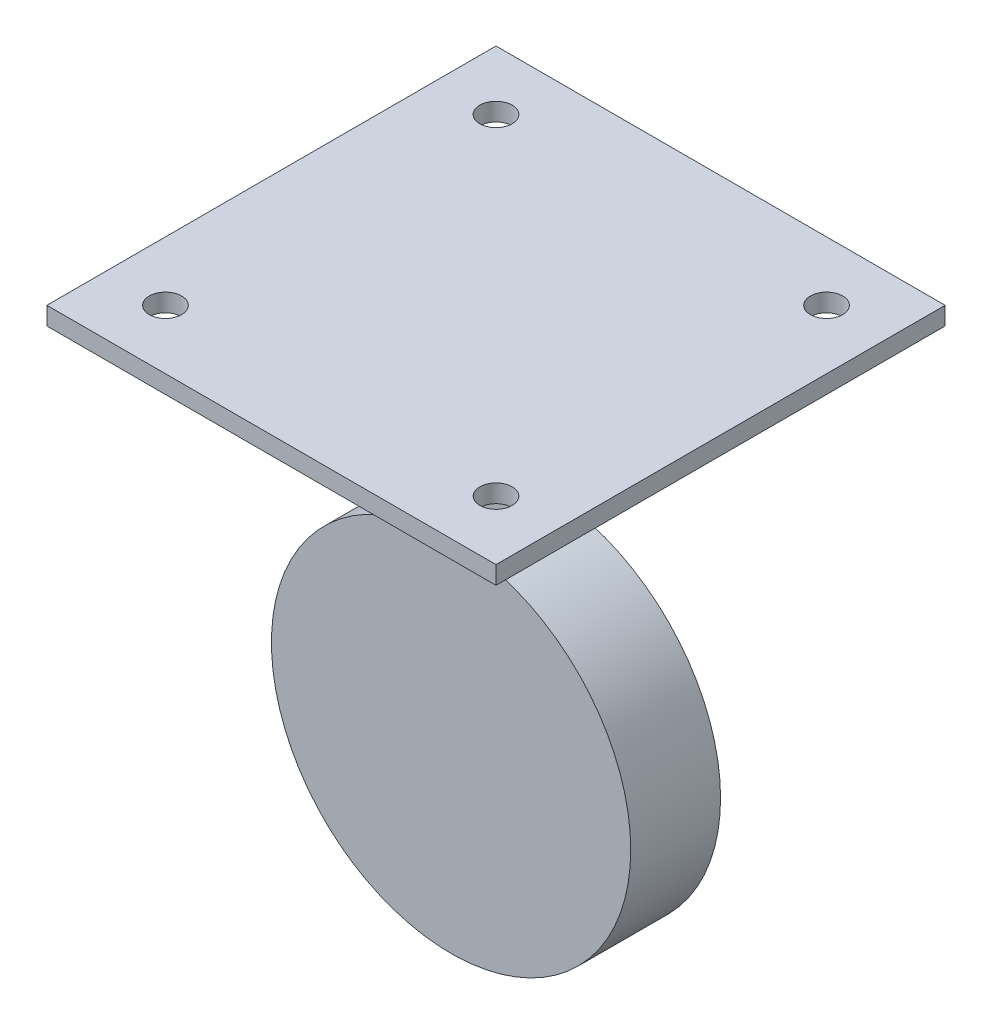
ISO-10303-21;
HEADER;
FILE_DESCRIPTION(('STEP AP214'),'2;1');
FILE_NAME('part.step','',(''),(''),'','','');
FILE_SCHEMA(('AUTOMOTIVE_DESIGN { 1 0 10303 214 1 1 1 1 }'));
ENDSEC;
DATA;
#1=APPLICATION_CONTEXT('core data for automotive mechanical design processes');
#2=APPLICATION_PROTOCOL_DEFINITION('international standard','automotive_design',2000,#1);
#3=PRODUCT_CONTEXT('',#1,'mechanical');
#4=PRODUCT('Part','Part','',(#3));
#5=PRODUCT_RELATED_PRODUCT_CATEGORY('part','',(#4));
#6=PRODUCT_DEFINITION_FORMATION('','',#4);
#7=PRODUCT_DEFINITION_CONTEXT('part definition',#1,'design');
#8=PRODUCT_DEFINITION('design','',#6,#7);
#9=PRODUCT_DEFINITION_SHAPE('','',#8);
#10=(LENGTH_UNIT() NAMED_UNIT(*) SI_UNIT(.MILLI.,.METRE.));
#11=(NAMED_UNIT(*) PLANE_ANGLE_UNIT() SI_UNIT($,.RADIAN.));
#12=(NAMED_UNIT(*) SI_UNIT($,.STERADIAN.) SOLID_ANGLE_UNIT());
#13=UNCERTAINTY_MEASURE_WITH_UNIT(LENGTH_MEASURE(1.E-05),#10,'distance_accuracy_value','');
#14=(GEOMETRIC_REPRESENTATION_CONTEXT(3) GLOBAL_UNCERTAINTY_ASSIGNED_CONTEXT((#13)) GLOBAL_UNIT_ASSIGNED_CONTEXT((#10,
#11,#12)) REPRESENTATION_CONTEXT('',''));
#15=CARTESIAN_POINT('',(0.,0.,0.));
#16=DIRECTION('',(0.,0.,1.));
#17=DIRECTION('',(1.,0.,0.));
#18=AXIS2_PLACEMENT_3D('',#15,#16,#17);
#19=CARTESIAN_POINT('',(-5.,0.,2.5));
#20=DIRECTION('',(-1.,0.,0.));
#21=DIRECTION('',(0.,0.,1.));
#22=AXIS2_PLACEMENT_3D('',#19,#20,#21);
#23=PLANE('',#22);
#24=DIRECTION('',(0.,1.,0.));
#25=VECTOR('',#24,1.);
#26=CARTESIAN_POINT('',(-5.,0.,2.5));
#27=LINE('',#26,#25);
#28=CARTESIAN_POINT('',(-5.,19.3649167310371,2.5));
#29=VERTEX_POINT('',#28);
#30=CARTESIAN_POINT('',(-5.,38.,2.5));
#31=VERTEX_POINT('',#30);
#32=EDGE_CURVE('E155',#29,#31,#27,.T.);
#33=ORIENTED_EDGE('',*,*,#32,.T.);
#34=DIRECTION('',(0.,0.,-1.));
#35=VECTOR('',#34,1.);
#36=CARTESIAN_POINT('',(-5.,38.,2.5));
#37=LINE('',#36,#35);
#38=CARTESIAN_POINT('',(-5.,38.,-2.5));
#39=VERTEX_POINT('',#38);
#40=EDGE_CURVE('E150',#31,#39,#37,.T.);
#41=ORIENTED_EDGE('',*,*,#40,.T.);
#42=DIRECTION('',(0.,1.,0.));
#43=VECTOR('',#42,1.);
#44=CARTESIAN_POINT('',(-5.,0.,-2.5));
#45=LINE('',#44,#43);
#46=CARTESIAN_POINT('',(-5.,19.3649167310371,-2.5));
#47=VERTEX_POINT('',#46);
#48=EDGE_CURVE('E154',#47,#39,#45,.T.);
#49=ORIENTED_EDGE('',*,*,#48,.F.);
#50=DIRECTION('',(0.,0.,-1.));
#51=VECTOR('',#50,1.);
#52=CARTESIAN_POINT('',(-5.,19.3649167310371,2.5));
#53=LINE('',#52,#51);
#54=EDGE_CURVE('E170',#29,#47,#53,.T.);
#55=ORIENTED_EDGE('',*,*,#54,.F.);
#56=EDGE_LOOP('',(#33,#41,#49,#55));
#57=FACE_BOUND('',#56,.T.);
#58=ADVANCED_FACE('F35',(#57),#23,.T.);
#59=CARTESIAN_POINT('',(5.,0.,2.5));
#60=DIRECTION('',(-1.,0.,0.));
#61=DIRECTION('',(0.,0.,1.));
#62=AXIS2_PLACEMENT_3D('',#59,#60,#61);
#63=PLANE('',#62);
#64=DIRECTION('',(0.,0.,-1.));
#65=VECTOR('',#64,1.);
#66=CARTESIAN_POINT('',(5.,38.,2.5));
#67=LINE('',#66,#65);
#68=CARTESIAN_POINT('',(5.,38.,2.5));
#69=VERTEX_POINT('',#68);
#70=CARTESIAN_POINT('',(5.,38.,-2.5));
#71=VERTEX_POINT('',#70);
#72=EDGE_CURVE('E50',#69,#71,#67,.T.);
#73=ORIENTED_EDGE('',*,*,#72,.F.);
#74=DIRECTION('',(0.,1.,0.));
#75=VECTOR('',#74,1.);
#76=CARTESIAN_POINT('',(5.,0.,2.5));
#77=LINE('',#76,#75);
#78=CARTESIAN_POINT('',(5.,19.3649167310371,2.5));
#79=VERTEX_POINT('',#78);
#80=EDGE_CURVE('E160',#79,#69,#77,.T.);
#81=ORIENTED_EDGE('',*,*,#80,.F.);
#82=DIRECTION('',(0.,0.,-1.));
#83=VECTOR('',#82,1.);
#84=CARTESIAN_POINT('',(5.,19.3649167310371,2.5));
#85=LINE('',#84,#83);
#86=CARTESIAN_POINT('',(5.,19.3649167310371,-2.5));
#87=VERTEX_POINT('',#86);
#88=EDGE_CURVE('E162',#79,#87,#85,.T.);
#89=ORIENTED_EDGE('',*,*,#88,.T.);
#90=DIRECTION('',(0.,1.,0.));
#91=VECTOR('',#90,1.);
#92=CARTESIAN_POINT('',(5.,0.,-2.5));
#93=LINE('',#92,#91);
#94=EDGE_CURVE('E158',#87,#71,#93,.T.);
#95=ORIENTED_EDGE('',*,*,#94,.T.);
#96=EDGE_LOOP('',(#73,#81,#89,#95));
#97=FACE_BOUND('',#96,.T.);
#98=ADVANCED_FACE('F191',(#97),#63,.F.);
#99=CARTESIAN_POINT('',(0.,0.,2.5));
#100=DIRECTION('',(0.,0.,1.));
#101=DIRECTION('',(1.,0.,0.));
#102=AXIS2_PLACEMENT_3D('',#99,#100,#101);
#103=PLANE('',#102);
#104=ORIENTED_EDGE('',*,*,#80,.T.);
#105=DIRECTION('',(-1.,0.,0.));
#106=VECTOR('',#105,1.);
#107=CARTESIAN_POINT('',(0.,38.,2.5));
#108=LINE('',#107,#106);
#109=EDGE_CURVE('E57',#69,#31,#108,.T.);
#110=ORIENTED_EDGE('',*,*,#109,.T.);
#111=ORIENTED_EDGE('',*,*,#32,.F.);
#112=CARTESIAN_POINT('',(0.,0.,2.5));
#113=DIRECTION('',(0.,0.,1.));
#114=DIRECTION('',(1.,0.,0.));
#115=AXIS2_PLACEMENT_3D('',#112,#113,#114);
#116=CIRCLE('',#115,20.);
#117=EDGE_CURVE('E157',#79,#29,#116,.T.);
#118=ORIENTED_EDGE('',*,*,#117,.F.);
#119=EDGE_LOOP('',(#104,#110,#111,#118));
#120=FACE_BOUND('',#119,.T.);
#121=ADVANCED_FACE('F198',(#120),#103,.T.);
#122=CARTESIAN_POINT('',(0.,0.,-2.5));
#123=DIRECTION('',(0.,0.,1.));
#124=DIRECTION('',(1.,0.,0.));
#125=AXIS2_PLACEMENT_3D('',#122,#123,#124);
#126=PLANE('',#125);
#127=DIRECTION('',(-1.,0.,0.));
#128=VECTOR('',#127,1.);
#129=CARTESIAN_POINT('',(0.,38.,-2.5));
#130=LINE('',#129,#128);
#131=EDGE_CURVE('E11',#71,#39,#130,.T.);
#132=ORIENTED_EDGE('',*,*,#131,.F.);
#133=ORIENTED_EDGE('',*,*,#94,.F.);
#134=CARTESIAN_POINT('',(0.,0.,-2.5));
#135=DIRECTION('',(0.,0.,1.));
#136=DIRECTION('',(1.,0.,0.));
#137=AXIS2_PLACEMENT_3D('',#134,#135,#136);
#138=CIRCLE('',#137,20.);
#139=EDGE_CURVE('E164',#87,#47,#138,.T.);
#140=ORIENTED_EDGE('',*,*,#139,.T.);
#141=ORIENTED_EDGE('',*,*,#48,.T.);
#142=EDGE_LOOP('',(#132,#133,#140,#141));
#143=FACE_BOUND('',#142,.T.);
#144=ADVANCED_FACE('F243',(#143),#126,.F.);
#145=CARTESIAN_POINT('',(0.,0.,5.));
#146=DIRECTION('',(0.,0.,-1.));
#147=DIRECTION('',(-1.,0.,0.));
#148=AXIS2_PLACEMENT_3D('',#145,#146,#147);
#149=CYLINDRICAL_SURFACE('',#148,20.);
#150=ORIENTED_EDGE('',*,*,#88,.F.);
#151=ORIENTED_EDGE('',*,*,#117,.T.);
#152=ORIENTED_EDGE('',*,*,#54,.T.);
#153=ORIENTED_EDGE('',*,*,#139,.F.);
#154=EDGE_LOOP('',(#150,#151,#152,#153));
#155=FACE_BOUND('',#154,.T.);
#156=CARTESIAN_POINT('',(0.,0.,5.));
#157=DIRECTION('',(0.,0.,1.));
#158=DIRECTION('',(1.,0.,0.));
#159=AXIS2_PLACEMENT_3D('',#156,#157,#158);
#160=CIRCLE('',#159,20.);
#161=CARTESIAN_POINT('',(20.,0.,5.));
#162=VERTEX_POINT('',#161);
#163=EDGE_CURVE('E43',#162,#162,#160,.T.);
#164=ORIENTED_EDGE('',*,*,#163,.F.);
#165=EDGE_LOOP('',(#164));
#166=FACE_BOUND('',#165,.T.);
#167=CARTESIAN_POINT('',(0.,0.,-5.));
#168=DIRECTION('',(0.,0.,1.));
#169=DIRECTION('',(1.,0.,0.));
#170=AXIS2_PLACEMENT_3D('',#167,#168,#169);
#171=CIRCLE('',#170,20.);
#172=CARTESIAN_POINT('',(20.,0.,-5.));
#173=VERTEX_POINT('',#172);
#174=EDGE_CURVE('E172',#173,#173,#171,.T.);
#175=ORIENTED_EDGE('',*,*,#174,.T.);
#176=EDGE_LOOP('',(#175));
#177=FACE_BOUND('',#176,.T.);
#178=ADVANCED_FACE('F37',(#155,#166,#177),#149,.T.);
#179=CARTESIAN_POINT('',(0.,0.,5.));
#180=DIRECTION('',(0.,0.,1.));
#181=DIRECTION('',(1.,0.,0.));
#182=AXIS2_PLACEMENT_3D('',#179,#180,#181);
#183=PLANE('',#182);
#184=ORIENTED_EDGE('',*,*,#163,.T.);
#185=EDGE_LOOP('',(#184));
#186=FACE_BOUND('',#185,.T.);
#187=ADVANCED_FACE('F180',(#186),#183,.T.);
#188=CARTESIAN_POINT('',(0.,0.,-5.));
#189=DIRECTION('',(0.,0.,1.));
#190=DIRECTION('',(1.,0.,0.));
#191=AXIS2_PLACEMENT_3D('',#188,#189,#190);
#192=PLANE('',#191);
#193=ORIENTED_EDGE('',*,*,#174,.F.);
#194=EDGE_LOOP('',(#193));
#195=FACE_BOUND('',#194,.T.);
#196=ADVANCED_FACE('F178',(#195),#192,.F.);
#197=CARTESIAN_POINT('',(-25.,38.,25.));
#198=DIRECTION('',(-1.,0.,0.));
#199=DIRECTION('',(0.,0.,1.));
#200=AXIS2_PLACEMENT_3D('',#197,#198,#199);
#201=PLANE('',#200);
#202=DIRECTION('',(0.,0.,1.));
#203=VECTOR('',#202,1.);
#204=CARTESIAN_POINT('',(-25.,40.,25.));
#205=LINE('',#204,#203);
#206=CARTESIAN_POINT('',(-25.,40.,-25.));
#207=VERTEX_POINT('',#206);
#208=CARTESIAN_POINT('',(-25.,40.,25.));
#209=VERTEX_POINT('',#208);
#210=EDGE_CURVE('E139',#207,#209,#205,.T.);
#211=ORIENTED_EDGE('',*,*,#210,.F.);
#212=DIRECTION('',(0.,1.,0.));
#213=VECTOR('',#212,1.);
#214=CARTESIAN_POINT('',(-25.,38.,-25.));
#215=LINE('',#214,#213);
#216=CARTESIAN_POINT('',(-25.,38.,-25.));
#217=VERTEX_POINT('',#216);
#218=EDGE_CURVE('E127',#217,#207,#215,.T.);
#219=ORIENTED_EDGE('',*,*,#218,.F.);
#220=DIRECTION('',(0.,0.,1.));
#221=VECTOR('',#220,1.);
#222=CARTESIAN_POINT('',(-25.,38.,25.));
#223=LINE('',#222,#221);
#224=CARTESIAN_POINT('',(-25.,38.,25.));
#225=VERTEX_POINT('',#224);
#226=EDGE_CURVE('E121',#217,#225,#223,.T.);
#227=ORIENTED_EDGE('',*,*,#226,.T.);
#228=DIRECTION('',(0.,1.,0.));
#229=VECTOR('',#228,1.);
#230=CARTESIAN_POINT('',(-25.,38.,25.));
#231=LINE('',#230,#229);
#232=EDGE_CURVE('E103',#225,#209,#231,.T.);
#233=ORIENTED_EDGE('',*,*,#232,.T.);
#234=EDGE_LOOP('',(#211,#219,#227,#233));
#235=FACE_BOUND('',#234,.T.);
#236=ADVANCED_FACE('F126',(#235),#201,.T.);
#237=CARTESIAN_POINT('',(25.,38.,-25.));
#238=DIRECTION('',(0.,0.,-1.));
#239=DIRECTION('',(-1.,0.,0.));
#240=AXIS2_PLACEMENT_3D('',#237,#238,#239);
#241=PLANE('',#240);
#242=DIRECTION('',(-1.,0.,0.));
#243=VECTOR('',#242,1.);
#244=CARTESIAN_POINT('',(25.,40.,-25.));
#245=LINE('',#244,#243);
#246=CARTESIAN_POINT('',(25.,40.,-25.));
#247=VERTEX_POINT('',#246);
#248=EDGE_CURVE('E128',#247,#207,#245,.T.);
#249=ORIENTED_EDGE('',*,*,#248,.F.);
#250=DIRECTION('',(0.,1.,0.));
#251=VECTOR('',#250,1.);
#252=CARTESIAN_POINT('',(25.,38.,-25.));
#253=LINE('',#252,#251);
#254=CARTESIAN_POINT('',(25.,38.,-25.));
#255=VERTEX_POINT('',#254);
#256=EDGE_CURVE('E146',#255,#247,#253,.T.);
#257=ORIENTED_EDGE('',*,*,#256,.F.);
#258=DIRECTION('',(-1.,0.,0.));
#259=VECTOR('',#258,1.);
#260=CARTESIAN_POINT('',(25.,38.,-25.));
#261=LINE('',#260,#259);
#262=EDGE_CURVE('E114',#255,#217,#261,.T.);
#263=ORIENTED_EDGE('',*,*,#262,.T.);
#264=ORIENTED_EDGE('',*,*,#218,.T.);
#265=EDGE_LOOP('',(#249,#257,#263,#264));
#266=FACE_BOUND('',#265,.T.);
#267=ADVANCED_FACE('F186',(#266),#241,.T.);
#268=CARTESIAN_POINT('',(25.,38.,25.));
#269=DIRECTION('',(1.,0.,0.));
#270=DIRECTION('',(0.,0.,-1.));
#271=AXIS2_PLACEMENT_3D('',#268,#269,#270);
#272=PLANE('',#271);
#273=DIRECTION('',(0.,0.,-1.));
#274=VECTOR('',#273,1.);
#275=CARTESIAN_POINT('',(25.,40.,25.));
#276=LINE('',#275,#274);
#277=CARTESIAN_POINT('',(25.,40.,25.));
#278=VERTEX_POINT('',#277);
#279=EDGE_CURVE('E131',#278,#247,#276,.T.);
#280=ORIENTED_EDGE('',*,*,#279,.F.);
#281=DIRECTION('',(0.,1.,0.));
#282=VECTOR('',#281,1.);
#283=CARTESIAN_POINT('',(25.,38.,25.));
#284=LINE('',#283,#282);
#285=CARTESIAN_POINT('',(25.,38.,25.));
#286=VERTEX_POINT('',#285);
#287=EDGE_CURVE('E113',#286,#278,#284,.T.);
#288=ORIENTED_EDGE('',*,*,#287,.F.);
#289=DIRECTION('',(0.,0.,-1.));
#290=VECTOR('',#289,1.);
#291=CARTESIAN_POINT('',(25.,38.,25.));
#292=LINE('',#291,#290);
#293=EDGE_CURVE('E124',#286,#255,#292,.T.);
#294=ORIENTED_EDGE('',*,*,#293,.T.);
#295=ORIENTED_EDGE('',*,*,#256,.T.);
#296=EDGE_LOOP('',(#280,#288,#294,#295));
#297=FACE_BOUND('',#296,.T.);
#298=ADVANCED_FACE('F231',(#297),#272,.T.);
#299=CARTESIAN_POINT('',(25.,38.,25.));
#300=DIRECTION('',(0.,0.,1.));
#301=DIRECTION('',(1.,0.,0.));
#302=AXIS2_PLACEMENT_3D('',#299,#300,#301);
#303=PLANE('',#302);
#304=DIRECTION('',(1.,0.,0.));
#305=VECTOR('',#304,1.);
#306=CARTESIAN_POINT('',(25.,40.,25.));
#307=LINE('',#306,#305);
#308=EDGE_CURVE('E108',#209,#278,#307,.T.);
#309=ORIENTED_EDGE('',*,*,#308,.F.);
#310=ORIENTED_EDGE('',*,*,#232,.F.);
#311=DIRECTION('',(1.,0.,0.));
#312=VECTOR('',#311,1.);
#313=CARTESIAN_POINT('',(25.,38.,25.));
#314=LINE('',#313,#312);
#315=EDGE_CURVE('E106',#225,#286,#314,.T.);
#316=ORIENTED_EDGE('',*,*,#315,.T.);
#317=ORIENTED_EDGE('',*,*,#287,.T.);
#318=EDGE_LOOP('',(#309,#310,#316,#317));
#319=FACE_BOUND('',#318,.T.);
#320=ADVANCED_FACE('F105',(#319),#303,.T.);
#321=CARTESIAN_POINT('',(0.,38.,0.));
#322=DIRECTION('',(0.,1.,0.));
#323=DIRECTION('',(0.,0.,1.));
#324=AXIS2_PLACEMENT_3D('',#321,#322,#323);
#325=PLANE('',#324);
#326=ORIENTED_EDGE('',*,*,#109,.F.);
#327=ORIENTED_EDGE('',*,*,#72,.T.);
#328=ORIENTED_EDGE('',*,*,#131,.T.);
#329=ORIENTED_EDGE('',*,*,#40,.F.);
#330=EDGE_LOOP('',(#326,#327,#328,#329));
#331=FACE_BOUND('',#330,.T.);
#332=CARTESIAN_POINT('',(-18.4,38.,18.4));
#333=DIRECTION('',(0.,1.,0.));
#334=DIRECTION('',(0.,0.,1.));
#335=AXIS2_PLACEMENT_3D('',#332,#333,#334);
#336=CIRCLE('',#335,1.8);
#337=CARTESIAN_POINT('',(-18.4,38.,20.2));
#338=VERTEX_POINT('',#337);
#339=EDGE_CURVE('E265',#338,#338,#336,.T.);
#340=ORIENTED_EDGE('',*,*,#339,.T.);
#341=EDGE_LOOP('',(#340));
#342=FACE_BOUND('',#341,.T.);
#343=CARTESIAN_POINT('',(18.4,38.,18.4));
#344=DIRECTION('',(0.,1.,0.));
#345=DIRECTION('',(0.,0.,1.));
#346=AXIS2_PLACEMENT_3D('',#343,#344,#345);
#347=CIRCLE('',#346,1.8);
#348=CARTESIAN_POINT('',(18.4,38.,20.2));
#349=VERTEX_POINT('',#348);
#350=EDGE_CURVE('E269',#349,#349,#347,.T.);
#351=ORIENTED_EDGE('',*,*,#350,.T.);
#352=EDGE_LOOP('',(#351));
#353=FACE_BOUND('',#352,.T.);
#354=CARTESIAN_POINT('',(18.4,38.,-18.4));
#355=DIRECTION('',(0.,1.,0.));
#356=DIRECTION('',(0.,0.,1.));
#357=AXIS2_PLACEMENT_3D('',#354,#355,#356);
#358=CIRCLE('',#357,1.8);
#359=CARTESIAN_POINT('',(18.4,38.,-16.6));
#360=VERTEX_POINT('',#359);
#361=EDGE_CURVE('E273',#360,#360,#358,.T.);
#362=ORIENTED_EDGE('',*,*,#361,.T.);
#363=EDGE_LOOP('',(#362));
#364=FACE_BOUND('',#363,.T.);
#365=CARTESIAN_POINT('',(-18.4,38.,-18.4));
#366=DIRECTION('',(0.,1.,0.));
#367=DIRECTION('',(0.,0.,1.));
#368=AXIS2_PLACEMENT_3D('',#365,#366,#367);
#369=CIRCLE('',#368,1.8);
#370=CARTESIAN_POINT('',(-18.4,38.,-16.6));
#371=VERTEX_POINT('',#370);
#372=EDGE_CURVE('E141',#371,#371,#369,.T.);
#373=ORIENTED_EDGE('',*,*,#372,.T.);
#374=EDGE_LOOP('',(#373));
#375=FACE_BOUND('',#374,.T.);
#376=ORIENTED_EDGE('',*,*,#226,.F.);
#377=ORIENTED_EDGE('',*,*,#262,.F.);
#378=ORIENTED_EDGE('',*,*,#293,.F.);
#379=ORIENTED_EDGE('',*,*,#315,.F.);
#380=EDGE_LOOP('',(#376,#377,#378,#379));
#381=FACE_BOUND('',#380,.T.);
#382=ADVANCED_FACE('F119',(#331,#342,#353,#364,#375,#381),#325,.F.);
#383=CARTESIAN_POINT('',(-18.4,38.,-18.4));
#384=DIRECTION('',(0.,1.,0.));
#385=DIRECTION('',(0.,0.,1.));
#386=AXIS2_PLACEMENT_3D('',#383,#384,#385);
#387=CYLINDRICAL_SURFACE('',#386,1.8);
#388=ORIENTED_EDGE('',*,*,#372,.F.);
#389=EDGE_LOOP('',(#388));
#390=FACE_BOUND('',#389,.T.);
#391=CARTESIAN_POINT('',(-18.4,40.,-18.4));
#392=DIRECTION('',(0.,1.,0.));
#393=DIRECTION('',(0.,0.,1.));
#394=AXIS2_PLACEMENT_3D('',#391,#392,#393);
#395=CIRCLE('',#394,1.8);
#396=CARTESIAN_POINT('',(-18.4,40.,-16.6));
#397=VERTEX_POINT('',#396);
#398=EDGE_CURVE('E134',#397,#397,#395,.T.);
#399=ORIENTED_EDGE('',*,*,#398,.T.);
#400=EDGE_LOOP('',(#399));
#401=FACE_BOUND('',#400,.T.);
#402=ADVANCED_FACE('F261',(#390,#401),#387,.F.);
#403=CARTESIAN_POINT('',(18.4,38.,-18.4));
#404=DIRECTION('',(0.,1.,0.));
#405=DIRECTION('',(0.,0.,1.));
#406=AXIS2_PLACEMENT_3D('',#403,#404,#405);
#407=CYLINDRICAL_SURFACE('',#406,1.8);
#408=ORIENTED_EDGE('',*,*,#361,.F.);
#409=EDGE_LOOP('',(#408));
#410=FACE_BOUND('',#409,.T.);
#411=CARTESIAN_POINT('',(18.4,40.,-18.4));
#412=DIRECTION('',(0.,1.,0.));
#413=DIRECTION('',(0.,0.,1.));
#414=AXIS2_PLACEMENT_3D('',#411,#412,#413);
#415=CIRCLE('',#414,1.8);
#416=CARTESIAN_POINT('',(18.4,40.,-16.6));
#417=VERTEX_POINT('',#416);
#418=EDGE_CURVE('E223',#417,#417,#415,.T.);
#419=ORIENTED_EDGE('',*,*,#418,.T.);
#420=EDGE_LOOP('',(#419));
#421=FACE_BOUND('',#420,.T.);
#422=ADVANCED_FACE('F286',(#410,#421),#407,.F.);
#423=CARTESIAN_POINT('',(18.4,38.,18.4));
#424=DIRECTION('',(0.,1.,0.));
#425=DIRECTION('',(0.,0.,1.));
#426=AXIS2_PLACEMENT_3D('',#423,#424,#425);
#427=CYLINDRICAL_SURFACE('',#426,1.8);
#428=ORIENTED_EDGE('',*,*,#350,.F.);
#429=EDGE_LOOP('',(#428));
#430=FACE_BOUND('',#429,.T.);
#431=CARTESIAN_POINT('',(18.4,40.,18.4));
#432=DIRECTION('',(0.,1.,0.));
#433=DIRECTION('',(0.,0.,1.));
#434=AXIS2_PLACEMENT_3D('',#431,#432,#433);
#435=CIRCLE('',#434,1.8);
#436=CARTESIAN_POINT('',(18.4,40.,20.2));
#437=VERTEX_POINT('',#436);
#438=EDGE_CURVE('E219',#437,#437,#435,.T.);
#439=ORIENTED_EDGE('',*,*,#438,.T.);
#440=EDGE_LOOP('',(#439));
#441=FACE_BOUND('',#440,.T.);
#442=ADVANCED_FACE('F209',(#430,#441),#427,.F.);
#443=CARTESIAN_POINT('',(-18.4,38.,18.4));
#444=DIRECTION('',(0.,1.,0.));
#445=DIRECTION('',(0.,0.,1.));
#446=AXIS2_PLACEMENT_3D('',#443,#444,#445);
#447=CYLINDRICAL_SURFACE('',#446,1.8);
#448=ORIENTED_EDGE('',*,*,#339,.F.);
#449=EDGE_LOOP('',(#448));
#450=FACE_BOUND('',#449,.T.);
#451=CARTESIAN_POINT('',(-18.4,40.,18.4));
#452=DIRECTION('',(0.,1.,0.));
#453=DIRECTION('',(0.,0.,1.));
#454=AXIS2_PLACEMENT_3D('',#451,#452,#453);
#455=CIRCLE('',#454,1.8);
#456=CARTESIAN_POINT('',(-18.4,40.,20.2));
#457=VERTEX_POINT('',#456);
#458=EDGE_CURVE('E215',#457,#457,#455,.T.);
#459=ORIENTED_EDGE('',*,*,#458,.T.);
#460=EDGE_LOOP('',(#459));
#461=FACE_BOUND('',#460,.T.);
#462=ADVANCED_FACE('F204',(#450,#461),#447,.F.);
#463=CARTESIAN_POINT('',(0.,40.,2.5));
#464=DIRECTION('',(0.,1.,0.));
#465=DIRECTION('',(0.,0.,1.));
#466=AXIS2_PLACEMENT_3D('',#463,#464,#465);
#467=PLANE('',#466);
#468=ORIENTED_EDGE('',*,*,#458,.F.);
#469=EDGE_LOOP('',(#468));
#470=FACE_BOUND('',#469,.T.);
#471=ORIENTED_EDGE('',*,*,#438,.F.);
#472=EDGE_LOOP('',(#471));
#473=FACE_BOUND('',#472,.T.);
#474=ORIENTED_EDGE('',*,*,#418,.F.);
#475=EDGE_LOOP('',(#474));
#476=FACE_BOUND('',#475,.T.);
#477=ORIENTED_EDGE('',*,*,#398,.F.);
#478=EDGE_LOOP('',(#477));
#479=FACE_BOUND('',#478,.T.);
#480=ORIENTED_EDGE('',*,*,#210,.T.);
#481=ORIENTED_EDGE('',*,*,#308,.T.);
#482=ORIENTED_EDGE('',*,*,#279,.T.);
#483=ORIENTED_EDGE('',*,*,#248,.T.);
#484=EDGE_LOOP('',(#480,#481,#482,#483));
#485=FACE_BOUND('',#484,.T.);
#486=ADVANCED_FACE('F202',(#470,#473,#476,#479,#485),#467,.T.);
#487=CLOSED_SHELL('',(#58,#98,#121,#144,#178,#187,#196,#236,#267,#298,#320,#382,#402,#422,#442,
#462,#486));
#488=MANIFOLD_SOLID_BREP('B2',#487);
#489=ADVANCED_BREP_SHAPE_REPRESENTATION('',(#18,#488),#14);
#490=SHAPE_DEFINITION_REPRESENTATION(#9,#489);
ENDSEC;
END-ISO-10303-21;
